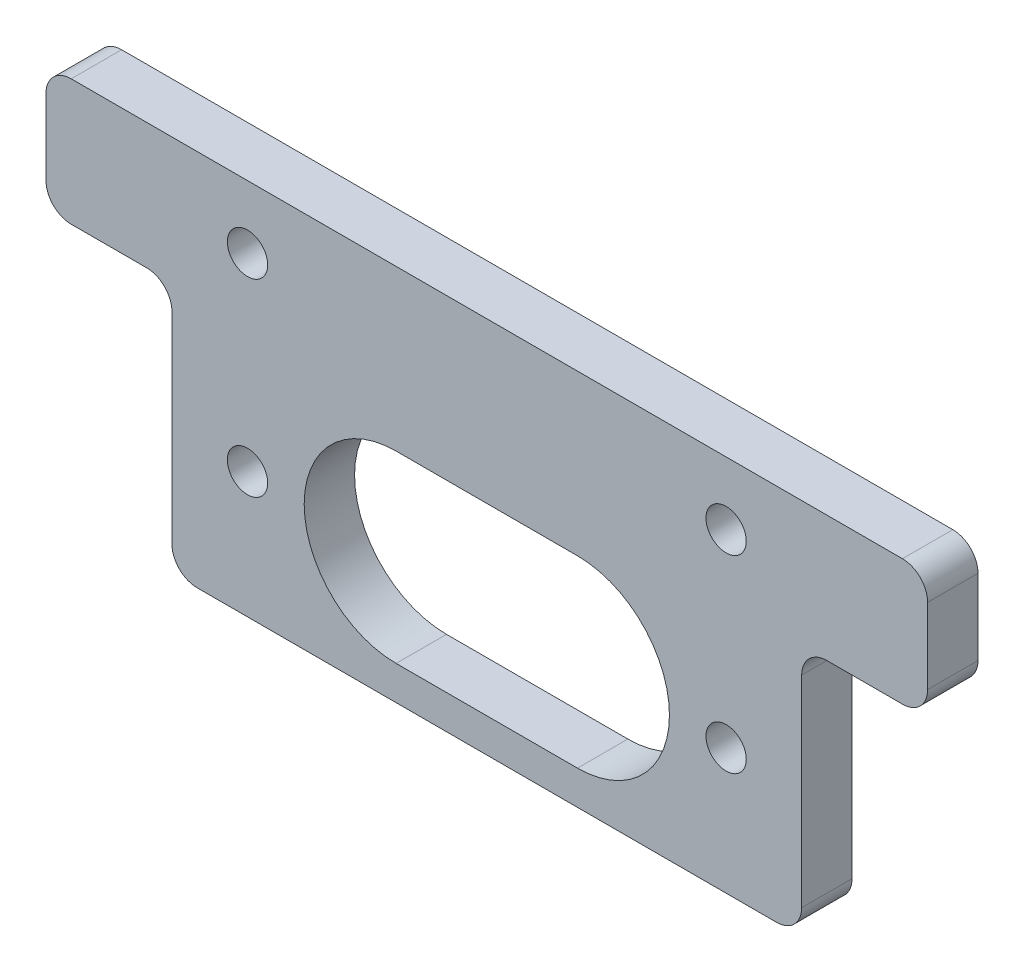
ISO-10303-21;
HEADER;
FILE_DESCRIPTION(('STEP AP214'),'2;1');
FILE_NAME('part.step','',(''),(''),'','','');
FILE_SCHEMA(('AUTOMOTIVE_DESIGN { 1 0 10303 214 1 1 1 1 }'));
ENDSEC;
DATA;
#1=APPLICATION_CONTEXT('core data for automotive mechanical design processes');
#2=APPLICATION_PROTOCOL_DEFINITION('international standard','automotive_design',2000,#1);
#3=PRODUCT_CONTEXT('',#1,'mechanical');
#4=PRODUCT('Part','Part','',(#3));
#5=PRODUCT_RELATED_PRODUCT_CATEGORY('part','',(#4));
#6=PRODUCT_DEFINITION_FORMATION('','',#4);
#7=PRODUCT_DEFINITION_CONTEXT('part definition',#1,'design');
#8=PRODUCT_DEFINITION('design','',#6,#7);
#9=PRODUCT_DEFINITION_SHAPE('','',#8);
#10=(LENGTH_UNIT() NAMED_UNIT(*) SI_UNIT(.MILLI.,.METRE.));
#11=(NAMED_UNIT(*) PLANE_ANGLE_UNIT() SI_UNIT($,.RADIAN.));
#12=(NAMED_UNIT(*) SI_UNIT($,.STERADIAN.) SOLID_ANGLE_UNIT());
#13=UNCERTAINTY_MEASURE_WITH_UNIT(LENGTH_MEASURE(1.E-05),#10,'distance_accuracy_value','');
#14=(GEOMETRIC_REPRESENTATION_CONTEXT(3) GLOBAL_UNCERTAINTY_ASSIGNED_CONTEXT((#13)) GLOBAL_UNIT_ASSIGNED_CONTEXT((#10,
#11,#12)) REPRESENTATION_CONTEXT('',''));
#15=CARTESIAN_POINT('',(0.,0.,0.));
#16=DIRECTION('',(0.,0.,1.));
#17=DIRECTION('',(1.,0.,0.));
#18=AXIS2_PLACEMENT_3D('',#15,#16,#17);
#19=CARTESIAN_POINT('',(-25.,20.,4.));
#20=DIRECTION('',(1.,0.,0.));
#21=DIRECTION('',(0.,0.,-1.));
#22=AXIS2_PLACEMENT_3D('',#19,#20,#21);
#23=PLANE('',#22);
#24=DIRECTION('',(0.,-1.,0.));
#25=VECTOR('',#24,1.);
#26=CARTESIAN_POINT('',(-25.,20.,0.));
#27=LINE('',#26,#25);
#28=CARTESIAN_POINT('',(-25.,18.,0.));
#29=VERTEX_POINT('',#28);
#30=CARTESIAN_POINT('',(-25.,2.,0.));
#31=VERTEX_POINT('',#30);
#32=EDGE_CURVE('E239',#29,#31,#27,.T.);
#33=ORIENTED_EDGE('',*,*,#32,.T.);
#34=DIRECTION('',(0.,0.,-1.));
#35=VECTOR('',#34,1.);
#36=CARTESIAN_POINT('',(-25.,2.,4.));
#37=LINE('',#36,#35);
#38=CARTESIAN_POINT('',(-25.,2.,4.));
#39=VERTEX_POINT('',#38);
#40=EDGE_CURVE('E342',#31,#39,#37,.F.);
#41=ORIENTED_EDGE('',*,*,#40,.T.);
#42=DIRECTION('',(0.,-1.,0.));
#43=VECTOR('',#42,1.);
#44=CARTESIAN_POINT('',(-25.,20.,4.));
#45=LINE('',#44,#43);
#46=CARTESIAN_POINT('',(-25.,18.,4.));
#47=VERTEX_POINT('',#46);
#48=EDGE_CURVE('E242',#47,#39,#45,.T.);
#49=ORIENTED_EDGE('',*,*,#48,.F.);
#50=DIRECTION('',(0.,0.,-1.));
#51=VECTOR('',#50,1.);
#52=CARTESIAN_POINT('',(-25.,18.,0.));
#53=LINE('',#52,#51);
#54=EDGE_CURVE('E339',#47,#29,#53,.T.);
#55=ORIENTED_EDGE('',*,*,#54,.T.);
#56=EDGE_LOOP('',(#33,#41,#49,#55));
#57=FACE_BOUND('',#56,.T.);
#58=ADVANCED_FACE('F36',(#57),#23,.F.);
#59=CARTESIAN_POINT('',(-25.,0.,4.));
#60=DIRECTION('',(0.,1.,0.));
#61=DIRECTION('',(0.,0.,1.));
#62=AXIS2_PLACEMENT_3D('',#59,#60,#61);
#63=PLANE('',#62);
#64=DIRECTION('',(1.,0.,0.));
#65=VECTOR('',#64,1.);
#66=CARTESIAN_POINT('',(-25.,0.,0.));
#67=LINE('',#66,#65);
#68=CARTESIAN_POINT('',(-23.,0.,0.));
#69=VERTEX_POINT('',#68);
#70=CARTESIAN_POINT('',(23.,0.,0.));
#71=VERTEX_POINT('',#70);
#72=EDGE_CURVE('E268',#69,#71,#67,.T.);
#73=ORIENTED_EDGE('',*,*,#72,.T.);
#74=DIRECTION('',(0.,0.,-1.));
#75=VECTOR('',#74,1.);
#76=CARTESIAN_POINT('',(23.,0.,4.));
#77=LINE('',#76,#75);
#78=CARTESIAN_POINT('',(23.,0.,4.));
#79=VERTEX_POINT('',#78);
#80=EDGE_CURVE('E337',#71,#79,#77,.F.);
#81=ORIENTED_EDGE('',*,*,#80,.T.);
#82=DIRECTION('',(1.,0.,0.));
#83=VECTOR('',#82,1.);
#84=CARTESIAN_POINT('',(-25.,0.,4.));
#85=LINE('',#84,#83);
#86=CARTESIAN_POINT('',(-23.,0.,4.));
#87=VERTEX_POINT('',#86);
#88=EDGE_CURVE('E245',#87,#79,#85,.T.);
#89=ORIENTED_EDGE('',*,*,#88,.F.);
#90=DIRECTION('',(0.,0.,-1.));
#91=VECTOR('',#90,1.);
#92=CARTESIAN_POINT('',(-23.,0.,4.));
#93=LINE('',#92,#91);
#94=EDGE_CURVE('E334',#87,#69,#93,.T.);
#95=ORIENTED_EDGE('',*,*,#94,.T.);
#96=EDGE_LOOP('',(#73,#81,#89,#95));
#97=FACE_BOUND('',#96,.T.);
#98=ADVANCED_FACE('F414',(#97),#63,.F.);
#99=CARTESIAN_POINT('',(25.,0.,4.));
#100=DIRECTION('',(-1.,0.,0.));
#101=DIRECTION('',(0.,0.,1.));
#102=AXIS2_PLACEMENT_3D('',#99,#100,#101);
#103=PLANE('',#102);
#104=DIRECTION('',(0.,1.,0.));
#105=VECTOR('',#104,1.);
#106=CARTESIAN_POINT('',(25.,0.,4.));
#107=LINE('',#106,#105);
#108=CARTESIAN_POINT('',(25.,2.,4.));
#109=VERTEX_POINT('',#108);
#110=CARTESIAN_POINT('',(25.,18.,4.));
#111=VERTEX_POINT('',#110);
#112=EDGE_CURVE('E249',#109,#111,#107,.T.);
#113=ORIENTED_EDGE('',*,*,#112,.F.);
#114=DIRECTION('',(0.,0.,-1.));
#115=VECTOR('',#114,1.);
#116=CARTESIAN_POINT('',(25.,2.,4.));
#117=LINE('',#116,#115);
#118=CARTESIAN_POINT('',(25.,2.,0.));
#119=VERTEX_POINT('',#118);
#120=EDGE_CURVE('E331',#109,#119,#117,.T.);
#121=ORIENTED_EDGE('',*,*,#120,.T.);
#122=DIRECTION('',(0.,1.,0.));
#123=VECTOR('',#122,1.);
#124=CARTESIAN_POINT('',(25.,0.,0.));
#125=LINE('',#124,#123);
#126=CARTESIAN_POINT('',(25.,18.,0.));
#127=VERTEX_POINT('',#126);
#128=EDGE_CURVE('E271',#119,#127,#125,.T.);
#129=ORIENTED_EDGE('',*,*,#128,.T.);
#130=DIRECTION('',(0.,0.,-1.));
#131=VECTOR('',#130,1.);
#132=CARTESIAN_POINT('',(25.,18.,4.));
#133=LINE('',#132,#131);
#134=EDGE_CURVE('E329',#127,#111,#133,.F.);
#135=ORIENTED_EDGE('',*,*,#134,.T.);
#136=EDGE_LOOP('',(#113,#121,#129,#135));
#137=FACE_BOUND('',#136,.T.);
#138=ADVANCED_FACE('F360',(#137),#103,.F.);
#139=CARTESIAN_POINT('',(25.,20.,4.));
#140=DIRECTION('',(0.,1.,0.));
#141=DIRECTION('',(-1.,0.,0.));
#142=AXIS2_PLACEMENT_3D('',#139,#140,#141);
#143=PLANE('',#142);
#144=DIRECTION('',(1.,0.,0.));
#145=VECTOR('',#144,1.);
#146=CARTESIAN_POINT('',(25.,20.,0.));
#147=LINE('',#146,#145);
#148=CARTESIAN_POINT('',(27.,20.,0.));
#149=VERTEX_POINT('',#148);
#150=CARTESIAN_POINT('',(33.,20.,0.));
#151=VERTEX_POINT('',#150);
#152=EDGE_CURVE('E274',#149,#151,#147,.T.);
#153=ORIENTED_EDGE('',*,*,#152,.T.);
#154=DIRECTION('',(0.,0.,-1.));
#155=VECTOR('',#154,1.);
#156=CARTESIAN_POINT('',(33.,20.,4.));
#157=LINE('',#156,#155);
#158=CARTESIAN_POINT('',(33.,20.,4.));
#159=VERTEX_POINT('',#158);
#160=EDGE_CURVE('E327',#151,#159,#157,.F.);
#161=ORIENTED_EDGE('',*,*,#160,.T.);
#162=DIRECTION('',(1.,0.,0.));
#163=VECTOR('',#162,1.);
#164=CARTESIAN_POINT('',(25.,20.,4.));
#165=LINE('',#164,#163);
#166=CARTESIAN_POINT('',(27.,20.,4.));
#167=VERTEX_POINT('',#166);
#168=EDGE_CURVE('E252',#167,#159,#165,.T.);
#169=ORIENTED_EDGE('',*,*,#168,.F.);
#170=DIRECTION('',(0.,0.,-1.));
#171=VECTOR('',#170,1.);
#172=CARTESIAN_POINT('',(27.,20.,0.));
#173=LINE('',#172,#171);
#174=EDGE_CURVE('E324',#167,#149,#173,.T.);
#175=ORIENTED_EDGE('',*,*,#174,.T.);
#176=EDGE_LOOP('',(#153,#161,#169,#175));
#177=FACE_BOUND('',#176,.T.);
#178=ADVANCED_FACE('F367',(#177),#143,.F.);
#179=CARTESIAN_POINT('',(35.,20.,4.));
#180=DIRECTION('',(-1.,0.,0.));
#181=DIRECTION('',(0.,0.,1.));
#182=AXIS2_PLACEMENT_3D('',#179,#180,#181);
#183=PLANE('',#182);
#184=DIRECTION('',(0.,1.,0.));
#185=VECTOR('',#184,1.);
#186=CARTESIAN_POINT('',(35.,20.,0.));
#187=LINE('',#186,#185);
#188=CARTESIAN_POINT('',(35.,22.,0.));
#189=VERTEX_POINT('',#188);
#190=CARTESIAN_POINT('',(35.,28.,0.));
#191=VERTEX_POINT('',#190);
#192=EDGE_CURVE('E277',#189,#191,#187,.T.);
#193=ORIENTED_EDGE('',*,*,#192,.T.);
#194=DIRECTION('',(0.,0.,-1.));
#195=VECTOR('',#194,1.);
#196=CARTESIAN_POINT('',(35.,28.,4.));
#197=LINE('',#196,#195);
#198=CARTESIAN_POINT('',(35.,28.,4.));
#199=VERTEX_POINT('',#198);
#200=EDGE_CURVE('E306',#191,#199,#197,.F.);
#201=ORIENTED_EDGE('',*,*,#200,.T.);
#202=DIRECTION('',(0.,1.,0.));
#203=VECTOR('',#202,1.);
#204=CARTESIAN_POINT('',(35.,20.,4.));
#205=LINE('',#204,#203);
#206=CARTESIAN_POINT('',(35.,22.,4.));
#207=VERTEX_POINT('',#206);
#208=EDGE_CURVE('E255',#207,#199,#205,.T.);
#209=ORIENTED_EDGE('',*,*,#208,.F.);
#210=DIRECTION('',(0.,0.,-1.));
#211=VECTOR('',#210,1.);
#212=CARTESIAN_POINT('',(35.,22.,4.));
#213=LINE('',#212,#211);
#214=EDGE_CURVE('E303',#207,#189,#213,.T.);
#215=ORIENTED_EDGE('',*,*,#214,.T.);
#216=EDGE_LOOP('',(#193,#201,#209,#215));
#217=FACE_BOUND('',#216,.T.);
#218=ADVANCED_FACE('F375',(#217),#183,.F.);
#219=CARTESIAN_POINT('',(35.,30.,4.));
#220=DIRECTION('',(0.,-1.,0.));
#221=DIRECTION('',(0.,0.,-1.));
#222=AXIS2_PLACEMENT_3D('',#219,#220,#221);
#223=PLANE('',#222);
#224=DIRECTION('',(-1.,0.,0.));
#225=VECTOR('',#224,1.);
#226=CARTESIAN_POINT('',(35.,30.,4.));
#227=LINE('',#226,#225);
#228=CARTESIAN_POINT('',(33.,30.,4.));
#229=VERTEX_POINT('',#228);
#230=CARTESIAN_POINT('',(-33.,30.,4.));
#231=VERTEX_POINT('',#230);
#232=EDGE_CURVE('E258',#229,#231,#227,.T.);
#233=ORIENTED_EDGE('',*,*,#232,.F.);
#234=DIRECTION('',(0.,0.,-1.));
#235=VECTOR('',#234,1.);
#236=CARTESIAN_POINT('',(33.,30.,4.));
#237=LINE('',#236,#235);
#238=CARTESIAN_POINT('',(33.,30.,0.));
#239=VERTEX_POINT('',#238);
#240=EDGE_CURVE('E288',#229,#239,#237,.T.);
#241=ORIENTED_EDGE('',*,*,#240,.T.);
#242=DIRECTION('',(-1.,0.,0.));
#243=VECTOR('',#242,1.);
#244=CARTESIAN_POINT('',(35.,30.,0.));
#245=LINE('',#244,#243);
#246=CARTESIAN_POINT('',(-33.,30.,0.));
#247=VERTEX_POINT('',#246);
#248=EDGE_CURVE('E280',#239,#247,#245,.T.);
#249=ORIENTED_EDGE('',*,*,#248,.T.);
#250=DIRECTION('',(0.,0.,-1.));
#251=VECTOR('',#250,1.);
#252=CARTESIAN_POINT('',(-33.,30.,4.));
#253=LINE('',#252,#251);
#254=EDGE_CURVE('E265',#247,#231,#253,.F.);
#255=ORIENTED_EDGE('',*,*,#254,.T.);
#256=EDGE_LOOP('',(#233,#241,#249,#255));
#257=FACE_BOUND('',#256,.T.);
#258=ADVANCED_FACE('F384',(#257),#223,.F.);
#259=CARTESIAN_POINT('',(-35.,30.,4.));
#260=DIRECTION('',(1.,0.,0.));
#261=DIRECTION('',(0.,0.,-1.));
#262=AXIS2_PLACEMENT_3D('',#259,#260,#261);
#263=PLANE('',#262);
#264=DIRECTION('',(0.,-1.,0.));
#265=VECTOR('',#264,1.);
#266=CARTESIAN_POINT('',(-35.,30.,4.));
#267=LINE('',#266,#265);
#268=CARTESIAN_POINT('',(-35.,28.,4.));
#269=VERTEX_POINT('',#268);
#270=CARTESIAN_POINT('',(-35.,22.,4.));
#271=VERTEX_POINT('',#270);
#272=EDGE_CURVE('E261',#269,#271,#267,.T.);
#273=ORIENTED_EDGE('',*,*,#272,.F.);
#274=DIRECTION('',(0.,0.,-1.));
#275=VECTOR('',#274,1.);
#276=CARTESIAN_POINT('',(-35.,28.,4.));
#277=LINE('',#276,#275);
#278=CARTESIAN_POINT('',(-35.,28.,0.));
#279=VERTEX_POINT('',#278);
#280=EDGE_CURVE('E321',#269,#279,#277,.T.);
#281=ORIENTED_EDGE('',*,*,#280,.T.);
#282=DIRECTION('',(0.,-1.,0.));
#283=VECTOR('',#282,1.);
#284=CARTESIAN_POINT('',(-35.,30.,0.));
#285=LINE('',#284,#283);
#286=CARTESIAN_POINT('',(-35.,22.,0.));
#287=VERTEX_POINT('',#286);
#288=EDGE_CURVE('E283',#279,#287,#285,.T.);
#289=ORIENTED_EDGE('',*,*,#288,.T.);
#290=DIRECTION('',(0.,0.,-1.));
#291=VECTOR('',#290,1.);
#292=CARTESIAN_POINT('',(-35.,22.,4.));
#293=LINE('',#292,#291);
#294=EDGE_CURVE('E319',#287,#271,#293,.F.);
#295=ORIENTED_EDGE('',*,*,#294,.T.);
#296=EDGE_LOOP('',(#273,#281,#289,#295));
#297=FACE_BOUND('',#296,.T.);
#298=ADVANCED_FACE('F391',(#297),#263,.F.);
#299=CARTESIAN_POINT('',(-35.,20.,4.));
#300=DIRECTION('',(0.,1.,0.));
#301=DIRECTION('',(-1.,0.,0.));
#302=AXIS2_PLACEMENT_3D('',#299,#300,#301);
#303=PLANE('',#302);
#304=DIRECTION('',(1.,0.,0.));
#305=VECTOR('',#304,1.);
#306=CARTESIAN_POINT('',(-35.,20.,4.));
#307=LINE('',#306,#305);
#308=CARTESIAN_POINT('',(-33.,20.,4.));
#309=VERTEX_POINT('',#308);
#310=CARTESIAN_POINT('',(-27.,20.,4.));
#311=VERTEX_POINT('',#310);
#312=EDGE_CURVE('E263',#309,#311,#307,.T.);
#313=ORIENTED_EDGE('',*,*,#312,.F.);
#314=DIRECTION('',(0.,0.,-1.));
#315=VECTOR('',#314,1.);
#316=CARTESIAN_POINT('',(-33.,20.,4.));
#317=LINE('',#316,#315);
#318=CARTESIAN_POINT('',(-33.,20.,0.));
#319=VERTEX_POINT('',#318);
#320=EDGE_CURVE('E345',#309,#319,#317,.T.);
#321=ORIENTED_EDGE('',*,*,#320,.T.);
#322=DIRECTION('',(1.,0.,0.));
#323=VECTOR('',#322,1.);
#324=CARTESIAN_POINT('',(-35.,20.,0.));
#325=LINE('',#324,#323);
#326=CARTESIAN_POINT('',(-27.,20.,0.));
#327=VERTEX_POINT('',#326);
#328=EDGE_CURVE('E246',#319,#327,#325,.T.);
#329=ORIENTED_EDGE('',*,*,#328,.T.);
#330=DIRECTION('',(0.,0.,-1.));
#331=VECTOR('',#330,1.);
#332=CARTESIAN_POINT('',(-27.,20.,4.));
#333=LINE('',#332,#331);
#334=EDGE_CURVE('E51',#327,#311,#333,.F.);
#335=ORIENTED_EDGE('',*,*,#334,.T.);
#336=EDGE_LOOP('',(#313,#321,#329,#335));
#337=FACE_BOUND('',#336,.T.);
#338=ADVANCED_FACE('F398',(#337),#303,.F.);
#339=CARTESIAN_POINT('',(0.,0.,4.));
#340=DIRECTION('',(0.,0.,1.));
#341=DIRECTION('',(1.,0.,0.));
#342=AXIS2_PLACEMENT_3D('',#339,#340,#341);
#343=PLANE('',#342);
#344=CARTESIAN_POINT('',(-7.2,10.,4.));
#345=DIRECTION('',(0.,0.,1.));
#346=DIRECTION('',(1.,0.,0.));
#347=AXIS2_PLACEMENT_3D('',#344,#345,#346);
#348=CIRCLE('',#347,7.3);
#349=CARTESIAN_POINT('',(-7.2,17.3,4.));
#350=VERTEX_POINT('',#349);
#351=CARTESIAN_POINT('',(-7.2,2.7,4.));
#352=VERTEX_POINT('',#351);
#353=EDGE_CURVE('E181',#350,#352,#348,.T.);
#354=ORIENTED_EDGE('',*,*,#353,.F.);
#355=DIRECTION('',(-1.,0.,0.));
#356=VECTOR('',#355,1.);
#357=CARTESIAN_POINT('',(-7.2,17.3,4.));
#358=LINE('',#357,#356);
#359=CARTESIAN_POINT('',(7.2,17.3,4.));
#360=VERTEX_POINT('',#359);
#361=EDGE_CURVE('E199',#360,#350,#358,.T.);
#362=ORIENTED_EDGE('',*,*,#361,.F.);
#363=CARTESIAN_POINT('',(7.2,10.,4.));
#364=DIRECTION('',(0.,0.,1.));
#365=DIRECTION('',(1.,0.,0.));
#366=AXIS2_PLACEMENT_3D('',#363,#364,#365);
#367=CIRCLE('',#366,7.3);
#368=CARTESIAN_POINT('',(7.2,2.7,4.));
#369=VERTEX_POINT('',#368);
#370=EDGE_CURVE('E202',#369,#360,#367,.T.);
#371=ORIENTED_EDGE('',*,*,#370,.F.);
#372=DIRECTION('',(1.,0.,0.));
#373=VECTOR('',#372,1.);
#374=CARTESIAN_POINT('',(-7.2,2.7,4.));
#375=LINE('',#374,#373);
#376=EDGE_CURVE('E208',#352,#369,#375,.T.);
#377=ORIENTED_EDGE('',*,*,#376,.F.);
#378=EDGE_LOOP('',(#354,#362,#371,#377));
#379=FACE_BOUND('',#378,.T.);
#380=CARTESIAN_POINT('',(19.,25.,4.));
#381=DIRECTION('',(0.,0.,1.));
#382=DIRECTION('',(1.,0.,0.));
#383=AXIS2_PLACEMENT_3D('',#380,#381,#382);
#384=CIRCLE('',#383,1.6);
#385=CARTESIAN_POINT('',(20.6,25.,4.));
#386=VERTEX_POINT('',#385);
#387=EDGE_CURVE('E228',#386,#386,#384,.T.);
#388=ORIENTED_EDGE('',*,*,#387,.F.);
#389=EDGE_LOOP('',(#388));
#390=FACE_BOUND('',#389,.T.);
#391=CARTESIAN_POINT('',(-19.,10.,4.));
#392=DIRECTION('',(0.,0.,1.));
#393=DIRECTION('',(-1.,0.,0.));
#394=AXIS2_PLACEMENT_3D('',#391,#392,#393);
#395=CIRCLE('',#394,1.6);
#396=CARTESIAN_POINT('',(-20.6,10.,4.));
#397=VERTEX_POINT('',#396);
#398=EDGE_CURVE('E221',#397,#397,#395,.T.);
#399=ORIENTED_EDGE('',*,*,#398,.F.);
#400=EDGE_LOOP('',(#399));
#401=FACE_BOUND('',#400,.T.);
#402=CARTESIAN_POINT('',(-19.,25.,4.));
#403=DIRECTION('',(0.,0.,1.));
#404=DIRECTION('',(-1.,0.,0.));
#405=AXIS2_PLACEMENT_3D('',#402,#403,#404);
#406=CIRCLE('',#405,1.6);
#407=CARTESIAN_POINT('',(-20.6,25.,4.));
#408=VERTEX_POINT('',#407);
#409=EDGE_CURVE('E214',#408,#408,#406,.T.);
#410=ORIENTED_EDGE('',*,*,#409,.F.);
#411=EDGE_LOOP('',(#410));
#412=FACE_BOUND('',#411,.T.);
#413=CARTESIAN_POINT('',(19.,10.,4.));
#414=DIRECTION('',(0.,0.,1.));
#415=DIRECTION('',(1.,0.,0.));
#416=AXIS2_PLACEMENT_3D('',#413,#414,#415);
#417=CIRCLE('',#416,1.6);
#418=CARTESIAN_POINT('',(20.6,10.,4.));
#419=VERTEX_POINT('',#418);
#420=EDGE_CURVE('E227',#419,#419,#417,.T.);
#421=ORIENTED_EDGE('',*,*,#420,.F.);
#422=EDGE_LOOP('',(#421));
#423=FACE_BOUND('',#422,.T.);
#424=ORIENTED_EDGE('',*,*,#208,.T.);
#425=CARTESIAN_POINT('',(33.,28.,4.));
#426=DIRECTION('',(0.,0.,1.));
#427=DIRECTION('',(1.,0.,0.));
#428=AXIS2_PLACEMENT_3D('',#425,#426,#427);
#429=CIRCLE('',#428,2.);
#430=EDGE_CURVE('E317',#199,#229,#429,.T.);
#431=ORIENTED_EDGE('',*,*,#430,.T.);
#432=ORIENTED_EDGE('',*,*,#232,.T.);
#433=CARTESIAN_POINT('',(-33.,28.,4.));
#434=DIRECTION('',(0.,0.,1.));
#435=DIRECTION('',(1.,0.,0.));
#436=AXIS2_PLACEMENT_3D('',#433,#434,#435);
#437=CIRCLE('',#436,2.);
#438=EDGE_CURVE('E315',#231,#269,#437,.T.);
#439=ORIENTED_EDGE('',*,*,#438,.T.);
#440=ORIENTED_EDGE('',*,*,#272,.T.);
#441=CARTESIAN_POINT('',(-33.,22.,4.));
#442=DIRECTION('',(0.,0.,1.));
#443=DIRECTION('',(1.,0.,0.));
#444=AXIS2_PLACEMENT_3D('',#441,#442,#443);
#445=CIRCLE('',#444,2.);
#446=EDGE_CURVE('E58',#271,#309,#445,.T.);
#447=ORIENTED_EDGE('',*,*,#446,.T.);
#448=ORIENTED_EDGE('',*,*,#312,.T.);
#449=CARTESIAN_POINT('',(-27.,18.,4.));
#450=DIRECTION('',(0.,0.,1.));
#451=DIRECTION('',(1.,0.,0.));
#452=AXIS2_PLACEMENT_3D('',#449,#450,#451);
#453=CIRCLE('',#452,2.);
#454=EDGE_CURVE('E350',#311,#47,#453,.F.);
#455=ORIENTED_EDGE('',*,*,#454,.T.);
#456=ORIENTED_EDGE('',*,*,#48,.T.);
#457=CARTESIAN_POINT('',(-23.,2.,4.));
#458=DIRECTION('',(0.,0.,1.));
#459=DIRECTION('',(1.,0.,0.));
#460=AXIS2_PLACEMENT_3D('',#457,#458,#459);
#461=CIRCLE('',#460,2.);
#462=EDGE_CURVE('E309',#39,#87,#461,.T.);
#463=ORIENTED_EDGE('',*,*,#462,.T.);
#464=ORIENTED_EDGE('',*,*,#88,.T.);
#465=CARTESIAN_POINT('',(23.,2.,4.));
#466=DIRECTION('',(0.,0.,1.));
#467=DIRECTION('',(1.,0.,0.));
#468=AXIS2_PLACEMENT_3D('',#465,#466,#467);
#469=CIRCLE('',#468,2.);
#470=EDGE_CURVE('E311',#79,#109,#469,.T.);
#471=ORIENTED_EDGE('',*,*,#470,.T.);
#472=ORIENTED_EDGE('',*,*,#112,.T.);
#473=CARTESIAN_POINT('',(27.,18.,4.));
#474=DIRECTION('',(0.,0.,1.));
#475=DIRECTION('',(1.,0.,0.));
#476=AXIS2_PLACEMENT_3D('',#473,#474,#475);
#477=CIRCLE('',#476,2.);
#478=EDGE_CURVE('E11',#111,#167,#477,.F.);
#479=ORIENTED_EDGE('',*,*,#478,.T.);
#480=ORIENTED_EDGE('',*,*,#168,.T.);
#481=CARTESIAN_POINT('',(33.,22.,4.));
#482=DIRECTION('',(0.,0.,1.));
#483=DIRECTION('',(1.,0.,0.));
#484=AXIS2_PLACEMENT_3D('',#481,#482,#483);
#485=CIRCLE('',#484,2.);
#486=EDGE_CURVE('E313',#159,#207,#485,.T.);
#487=ORIENTED_EDGE('',*,*,#486,.T.);
#488=EDGE_LOOP('',(#424,#431,#432,#439,#440,#447,#448,#455,#456,#463,#464,#471,#472,#479,#480,#487));
#489=FACE_BOUND('',#488,.T.);
#490=ADVANCED_FACE('F364',(#379,#390,#401,#412,#423,#489),#343,.T.);
#491=CARTESIAN_POINT('',(0.,0.,0.));
#492=DIRECTION('',(0.,0.,1.));
#493=DIRECTION('',(1.,0.,0.));
#494=AXIS2_PLACEMENT_3D('',#491,#492,#493);
#495=PLANE('',#494);
#496=DIRECTION('',(-1.,0.,0.));
#497=VECTOR('',#496,1.);
#498=CARTESIAN_POINT('',(-7.2,17.3,0.));
#499=LINE('',#498,#497);
#500=CARTESIAN_POINT('',(7.2,17.3,0.));
#501=VERTEX_POINT('',#500);
#502=CARTESIAN_POINT('',(-7.2,17.3,0.));
#503=VERTEX_POINT('',#502);
#504=EDGE_CURVE('E186',#501,#503,#499,.T.);
#505=ORIENTED_EDGE('',*,*,#504,.T.);
#506=CARTESIAN_POINT('',(-7.2,10.,0.));
#507=DIRECTION('',(0.,0.,1.));
#508=DIRECTION('',(1.,0.,0.));
#509=AXIS2_PLACEMENT_3D('',#506,#507,#508);
#510=CIRCLE('',#509,7.3);
#511=CARTESIAN_POINT('',(-7.2,2.7,0.));
#512=VERTEX_POINT('',#511);
#513=EDGE_CURVE('E178',#503,#512,#510,.T.);
#514=ORIENTED_EDGE('',*,*,#513,.T.);
#515=DIRECTION('',(1.,0.,0.));
#516=VECTOR('',#515,1.);
#517=CARTESIAN_POINT('',(-7.2,2.7,0.));
#518=LINE('',#517,#516);
#519=CARTESIAN_POINT('',(7.2,2.7,0.));
#520=VERTEX_POINT('',#519);
#521=EDGE_CURVE('E190',#512,#520,#518,.T.);
#522=ORIENTED_EDGE('',*,*,#521,.T.);
#523=CARTESIAN_POINT('',(7.2,10.,0.));
#524=DIRECTION('',(0.,0.,1.));
#525=DIRECTION('',(1.,0.,0.));
#526=AXIS2_PLACEMENT_3D('',#523,#524,#525);
#527=CIRCLE('',#526,7.3);
#528=EDGE_CURVE('E194',#520,#501,#527,.T.);
#529=ORIENTED_EDGE('',*,*,#528,.T.);
#530=EDGE_LOOP('',(#505,#514,#522,#529));
#531=FACE_BOUND('',#530,.T.);
#532=CARTESIAN_POINT('',(19.,25.,0.));
#533=DIRECTION('',(0.,0.,1.));
#534=DIRECTION('',(1.,0.,0.));
#535=AXIS2_PLACEMENT_3D('',#532,#533,#534);
#536=CIRCLE('',#535,1.6);
#537=CARTESIAN_POINT('',(20.6,25.,0.));
#538=VERTEX_POINT('',#537);
#539=EDGE_CURVE('E224',#538,#538,#536,.T.);
#540=ORIENTED_EDGE('',*,*,#539,.T.);
#541=EDGE_LOOP('',(#540));
#542=FACE_BOUND('',#541,.T.);
#543=CARTESIAN_POINT('',(-19.,10.,0.));
#544=DIRECTION('',(0.,0.,1.));
#545=DIRECTION('',(-1.,0.,0.));
#546=AXIS2_PLACEMENT_3D('',#543,#544,#545);
#547=CIRCLE('',#546,1.6);
#548=CARTESIAN_POINT('',(-20.6,10.,0.));
#549=VERTEX_POINT('',#548);
#550=EDGE_CURVE('E231',#549,#549,#547,.T.);
#551=ORIENTED_EDGE('',*,*,#550,.T.);
#552=EDGE_LOOP('',(#551));
#553=FACE_BOUND('',#552,.T.);
#554=CARTESIAN_POINT('',(-19.,25.,0.));
#555=DIRECTION('',(0.,0.,1.));
#556=DIRECTION('',(-1.,0.,0.));
#557=AXIS2_PLACEMENT_3D('',#554,#555,#556);
#558=CIRCLE('',#557,1.6);
#559=CARTESIAN_POINT('',(-20.6,25.,0.));
#560=VERTEX_POINT('',#559);
#561=EDGE_CURVE('E218',#560,#560,#558,.T.);
#562=ORIENTED_EDGE('',*,*,#561,.T.);
#563=EDGE_LOOP('',(#562));
#564=FACE_BOUND('',#563,.T.);
#565=CARTESIAN_POINT('',(19.,10.,0.));
#566=DIRECTION('',(0.,0.,1.));
#567=DIRECTION('',(1.,0.,0.));
#568=AXIS2_PLACEMENT_3D('',#565,#566,#567);
#569=CIRCLE('',#568,1.6);
#570=CARTESIAN_POINT('',(20.6,10.,0.));
#571=VERTEX_POINT('',#570);
#572=EDGE_CURVE('E236',#571,#571,#569,.T.);
#573=ORIENTED_EDGE('',*,*,#572,.T.);
#574=EDGE_LOOP('',(#573));
#575=FACE_BOUND('',#574,.T.);
#576=ORIENTED_EDGE('',*,*,#248,.F.);
#577=CARTESIAN_POINT('',(33.,28.,0.));
#578=DIRECTION('',(0.,0.,1.));
#579=DIRECTION('',(1.,0.,0.));
#580=AXIS2_PLACEMENT_3D('',#577,#578,#579);
#581=CIRCLE('',#580,2.);
#582=EDGE_CURVE('E301',#239,#191,#581,.F.);
#583=ORIENTED_EDGE('',*,*,#582,.T.);
#584=ORIENTED_EDGE('',*,*,#192,.F.);
#585=CARTESIAN_POINT('',(33.,22.,0.));
#586=DIRECTION('',(0.,0.,1.));
#587=DIRECTION('',(1.,0.,0.));
#588=AXIS2_PLACEMENT_3D('',#585,#586,#587);
#589=CIRCLE('',#588,2.);
#590=EDGE_CURVE('E297',#189,#151,#589,.F.);
#591=ORIENTED_EDGE('',*,*,#590,.T.);
#592=ORIENTED_EDGE('',*,*,#152,.F.);
#593=CARTESIAN_POINT('',(27.,18.,0.));
#594=DIRECTION('',(0.,0.,1.));
#595=DIRECTION('',(1.,0.,0.));
#596=AXIS2_PLACEMENT_3D('',#593,#594,#595);
#597=CIRCLE('',#596,2.);
#598=EDGE_CURVE('E44',#149,#127,#597,.T.);
#599=ORIENTED_EDGE('',*,*,#598,.T.);
#600=ORIENTED_EDGE('',*,*,#128,.F.);
#601=CARTESIAN_POINT('',(23.,2.,0.));
#602=DIRECTION('',(0.,0.,1.));
#603=DIRECTION('',(1.,0.,0.));
#604=AXIS2_PLACEMENT_3D('',#601,#602,#603);
#605=CIRCLE('',#604,2.);
#606=EDGE_CURVE('E295',#119,#71,#605,.F.);
#607=ORIENTED_EDGE('',*,*,#606,.T.);
#608=ORIENTED_EDGE('',*,*,#72,.F.);
#609=CARTESIAN_POINT('',(-23.,2.,0.));
#610=DIRECTION('',(0.,0.,1.));
#611=DIRECTION('',(1.,0.,0.));
#612=AXIS2_PLACEMENT_3D('',#609,#610,#611);
#613=CIRCLE('',#612,2.);
#614=EDGE_CURVE('E293',#69,#31,#613,.F.);
#615=ORIENTED_EDGE('',*,*,#614,.T.);
#616=ORIENTED_EDGE('',*,*,#32,.F.);
#617=CARTESIAN_POINT('',(-27.,18.,0.));
#618=DIRECTION('',(0.,0.,1.));
#619=DIRECTION('',(1.,0.,0.));
#620=AXIS2_PLACEMENT_3D('',#617,#618,#619);
#621=CIRCLE('',#620,2.);
#622=EDGE_CURVE('E348',#29,#327,#621,.T.);
#623=ORIENTED_EDGE('',*,*,#622,.T.);
#624=ORIENTED_EDGE('',*,*,#328,.F.);
#625=CARTESIAN_POINT('',(-33.,22.,0.));
#626=DIRECTION('',(0.,0.,1.));
#627=DIRECTION('',(1.,0.,0.));
#628=AXIS2_PLACEMENT_3D('',#625,#626,#627);
#629=CIRCLE('',#628,2.);
#630=EDGE_CURVE('E291',#319,#287,#629,.F.);
#631=ORIENTED_EDGE('',*,*,#630,.T.);
#632=ORIENTED_EDGE('',*,*,#288,.F.);
#633=CARTESIAN_POINT('',(-33.,28.,0.));
#634=DIRECTION('',(0.,0.,1.));
#635=DIRECTION('',(1.,0.,0.));
#636=AXIS2_PLACEMENT_3D('',#633,#634,#635);
#637=CIRCLE('',#636,2.);
#638=EDGE_CURVE('E299',#279,#247,#637,.F.);
#639=ORIENTED_EDGE('',*,*,#638,.T.);
#640=EDGE_LOOP('',(#576,#583,#584,#591,#592,#599,#600,#607,#608,#615,#616,#623,#624,#631,#632,#639));
#641=FACE_BOUND('',#640,.T.);
#642=ADVANCED_FACE('F196',(#531,#542,#553,#564,#575,#641),#495,.F.);
#643=CARTESIAN_POINT('',(19.,10.,0.));
#644=DIRECTION('',(0.,0.,1.));
#645=DIRECTION('',(1.,0.,0.));
#646=AXIS2_PLACEMENT_3D('',#643,#644,#645);
#647=CYLINDRICAL_SURFACE('',#646,1.6);
#648=ORIENTED_EDGE('',*,*,#572,.F.);
#649=EDGE_LOOP('',(#648));
#650=FACE_BOUND('',#649,.T.);
#651=ORIENTED_EDGE('',*,*,#420,.T.);
#652=EDGE_LOOP('',(#651));
#653=FACE_BOUND('',#652,.T.);
#654=ADVANCED_FACE('F546',(#650,#653),#647,.F.);
#655=CARTESIAN_POINT('',(-19.,25.,0.));
#656=DIRECTION('',(0.,0.,1.));
#657=DIRECTION('',(1.,0.,0.));
#658=AXIS2_PLACEMENT_3D('',#655,#656,#657);
#659=CYLINDRICAL_SURFACE('',#658,1.6);
#660=ORIENTED_EDGE('',*,*,#561,.F.);
#661=EDGE_LOOP('',(#660));
#662=FACE_BOUND('',#661,.T.);
#663=ORIENTED_EDGE('',*,*,#409,.T.);
#664=EDGE_LOOP('',(#663));
#665=FACE_BOUND('',#664,.T.);
#666=ADVANCED_FACE('F537',(#662,#665),#659,.F.);
#667=CARTESIAN_POINT('',(-19.,10.,0.));
#668=DIRECTION('',(0.,0.,1.));
#669=DIRECTION('',(1.,0.,0.));
#670=AXIS2_PLACEMENT_3D('',#667,#668,#669);
#671=CYLINDRICAL_SURFACE('',#670,1.6);
#672=ORIENTED_EDGE('',*,*,#550,.F.);
#673=EDGE_LOOP('',(#672));
#674=FACE_BOUND('',#673,.T.);
#675=ORIENTED_EDGE('',*,*,#398,.T.);
#676=EDGE_LOOP('',(#675));
#677=FACE_BOUND('',#676,.T.);
#678=ADVANCED_FACE('F528',(#674,#677),#671,.F.);
#679=CARTESIAN_POINT('',(19.,25.,0.));
#680=DIRECTION('',(0.,0.,1.));
#681=DIRECTION('',(1.,0.,0.));
#682=AXIS2_PLACEMENT_3D('',#679,#680,#681);
#683=CYLINDRICAL_SURFACE('',#682,1.6);
#684=ORIENTED_EDGE('',*,*,#539,.F.);
#685=EDGE_LOOP('',(#684));
#686=FACE_BOUND('',#685,.T.);
#687=ORIENTED_EDGE('',*,*,#387,.T.);
#688=EDGE_LOOP('',(#687));
#689=FACE_BOUND('',#688,.T.);
#690=ADVANCED_FACE('F520',(#686,#689),#683,.F.);
#691=CARTESIAN_POINT('',(-7.2,10.,0.));
#692=DIRECTION('',(0.,0.,1.));
#693=DIRECTION('',(1.,0.,0.));
#694=AXIS2_PLACEMENT_3D('',#691,#692,#693);
#695=CYLINDRICAL_SURFACE('',#694,7.3);
#696=ORIENTED_EDGE('',*,*,#353,.T.);
#697=DIRECTION('',(0.,0.,1.));
#698=VECTOR('',#697,1.);
#699=CARTESIAN_POINT('',(-7.2,2.7,0.));
#700=LINE('',#699,#698);
#701=EDGE_CURVE('E174',#512,#352,#700,.T.);
#702=ORIENTED_EDGE('',*,*,#701,.F.);
#703=ORIENTED_EDGE('',*,*,#513,.F.);
#704=DIRECTION('',(0.,0.,1.));
#705=VECTOR('',#704,1.);
#706=CARTESIAN_POINT('',(-7.2,17.3,0.));
#707=LINE('',#706,#705);
#708=EDGE_CURVE('E212',#503,#350,#707,.T.);
#709=ORIENTED_EDGE('',*,*,#708,.T.);
#710=EDGE_LOOP('',(#696,#702,#703,#709));
#711=FACE_BOUND('',#710,.T.);
#712=ADVANCED_FACE('F176',(#711),#695,.F.);
#713=CARTESIAN_POINT('',(-7.2,17.3,0.));
#714=DIRECTION('',(0.,1.,0.));
#715=DIRECTION('',(0.,0.,1.));
#716=AXIS2_PLACEMENT_3D('',#713,#714,#715);
#717=PLANE('',#716);
#718=ORIENTED_EDGE('',*,*,#361,.T.);
#719=ORIENTED_EDGE('',*,*,#708,.F.);
#720=ORIENTED_EDGE('',*,*,#504,.F.);
#721=DIRECTION('',(0.,0.,1.));
#722=VECTOR('',#721,1.);
#723=CARTESIAN_POINT('',(7.2,17.3,0.));
#724=LINE('',#723,#722);
#725=EDGE_CURVE('E215',#501,#360,#724,.T.);
#726=ORIENTED_EDGE('',*,*,#725,.T.);
#727=EDGE_LOOP('',(#718,#719,#720,#726));
#728=FACE_BOUND('',#727,.T.);
#729=ADVANCED_FACE('F503',(#728),#717,.F.);
#730=CARTESIAN_POINT('',(7.2,10.,0.));
#731=DIRECTION('',(0.,0.,1.));
#732=DIRECTION('',(1.,0.,0.));
#733=AXIS2_PLACEMENT_3D('',#730,#731,#732);
#734=CYLINDRICAL_SURFACE('',#733,7.3);
#735=ORIENTED_EDGE('',*,*,#370,.T.);
#736=ORIENTED_EDGE('',*,*,#725,.F.);
#737=ORIENTED_EDGE('',*,*,#528,.F.);
#738=DIRECTION('',(0.,0.,1.));
#739=VECTOR('',#738,1.);
#740=CARTESIAN_POINT('',(7.2,2.7,0.));
#741=LINE('',#740,#739);
#742=EDGE_CURVE('E185',#520,#369,#741,.T.);
#743=ORIENTED_EDGE('',*,*,#742,.T.);
#744=EDGE_LOOP('',(#735,#736,#737,#743));
#745=FACE_BOUND('',#744,.T.);
#746=ADVANCED_FACE('F495',(#745),#734,.F.);
#747=CARTESIAN_POINT('',(-7.2,2.7,0.));
#748=DIRECTION('',(0.,-1.,0.));
#749=DIRECTION('',(1.,0.,0.));
#750=AXIS2_PLACEMENT_3D('',#747,#748,#749);
#751=PLANE('',#750);
#752=ORIENTED_EDGE('',*,*,#376,.T.);
#753=ORIENTED_EDGE('',*,*,#742,.F.);
#754=ORIENTED_EDGE('',*,*,#521,.F.);
#755=ORIENTED_EDGE('',*,*,#701,.T.);
#756=EDGE_LOOP('',(#752,#753,#754,#755));
#757=FACE_BOUND('',#756,.T.);
#758=ADVANCED_FACE('F191',(#757),#751,.F.);
#759=CARTESIAN_POINT('',(33.,28.,4.));
#760=DIRECTION('',(0.,0.,-1.));
#761=DIRECTION('',(-1.,0.,0.));
#762=AXIS2_PLACEMENT_3D('',#759,#760,#761);
#763=CYLINDRICAL_SURFACE('',#762,2.);
#764=ORIENTED_EDGE('',*,*,#430,.F.);
#765=ORIENTED_EDGE('',*,*,#200,.F.);
#766=ORIENTED_EDGE('',*,*,#582,.F.);
#767=ORIENTED_EDGE('',*,*,#240,.F.);
#768=EDGE_LOOP('',(#764,#765,#766,#767));
#769=FACE_BOUND('',#768,.T.);
#770=ADVANCED_FACE('F379',(#769),#763,.T.);
#771=CARTESIAN_POINT('',(-33.,28.,4.));
#772=DIRECTION('',(0.,0.,-1.));
#773=DIRECTION('',(-1.,0.,0.));
#774=AXIS2_PLACEMENT_3D('',#771,#772,#773);
#775=CYLINDRICAL_SURFACE('',#774,2.);
#776=ORIENTED_EDGE('',*,*,#438,.F.);
#777=ORIENTED_EDGE('',*,*,#254,.F.);
#778=ORIENTED_EDGE('',*,*,#638,.F.);
#779=ORIENTED_EDGE('',*,*,#280,.F.);
#780=EDGE_LOOP('',(#776,#777,#778,#779));
#781=FACE_BOUND('',#780,.T.);
#782=ADVANCED_FACE('F387',(#781),#775,.T.);
#783=CARTESIAN_POINT('',(33.,22.,4.));
#784=DIRECTION('',(0.,0.,-1.));
#785=DIRECTION('',(-1.,0.,0.));
#786=AXIS2_PLACEMENT_3D('',#783,#784,#785);
#787=CYLINDRICAL_SURFACE('',#786,2.);
#788=ORIENTED_EDGE('',*,*,#486,.F.);
#789=ORIENTED_EDGE('',*,*,#160,.F.);
#790=ORIENTED_EDGE('',*,*,#590,.F.);
#791=ORIENTED_EDGE('',*,*,#214,.F.);
#792=EDGE_LOOP('',(#788,#789,#790,#791));
#793=FACE_BOUND('',#792,.T.);
#794=ADVANCED_FACE('F370',(#793),#787,.T.);
#795=CARTESIAN_POINT('',(23.,2.,4.));
#796=DIRECTION('',(0.,0.,-1.));
#797=DIRECTION('',(-1.,0.,0.));
#798=AXIS2_PLACEMENT_3D('',#795,#796,#797);
#799=CYLINDRICAL_SURFACE('',#798,2.);
#800=ORIENTED_EDGE('',*,*,#470,.F.);
#801=ORIENTED_EDGE('',*,*,#80,.F.);
#802=ORIENTED_EDGE('',*,*,#606,.F.);
#803=ORIENTED_EDGE('',*,*,#120,.F.);
#804=EDGE_LOOP('',(#800,#801,#802,#803));
#805=FACE_BOUND('',#804,.T.);
#806=ADVANCED_FACE('F418',(#805),#799,.T.);
#807=CARTESIAN_POINT('',(-23.,2.,4.));
#808=DIRECTION('',(0.,0.,-1.));
#809=DIRECTION('',(-1.,0.,0.));
#810=AXIS2_PLACEMENT_3D('',#807,#808,#809);
#811=CYLINDRICAL_SURFACE('',#810,2.);
#812=ORIENTED_EDGE('',*,*,#462,.F.);
#813=ORIENTED_EDGE('',*,*,#40,.F.);
#814=ORIENTED_EDGE('',*,*,#614,.F.);
#815=ORIENTED_EDGE('',*,*,#94,.F.);
#816=EDGE_LOOP('',(#812,#813,#814,#815));
#817=FACE_BOUND('',#816,.T.);
#818=ADVANCED_FACE('F411',(#817),#811,.T.);
#819=CARTESIAN_POINT('',(-33.,22.,4.));
#820=DIRECTION('',(0.,0.,-1.));
#821=DIRECTION('',(-1.,0.,0.));
#822=AXIS2_PLACEMENT_3D('',#819,#820,#821);
#823=CYLINDRICAL_SURFACE('',#822,2.);
#824=ORIENTED_EDGE('',*,*,#446,.F.);
#825=ORIENTED_EDGE('',*,*,#294,.F.);
#826=ORIENTED_EDGE('',*,*,#630,.F.);
#827=ORIENTED_EDGE('',*,*,#320,.F.);
#828=EDGE_LOOP('',(#824,#825,#826,#827));
#829=FACE_BOUND('',#828,.T.);
#830=ADVANCED_FACE('F395',(#829),#823,.T.);
#831=CARTESIAN_POINT('',(-27.,18.,4.));
#832=DIRECTION('',(0.,0.,1.));
#833=DIRECTION('',(1.,0.,0.));
#834=AXIS2_PLACEMENT_3D('',#831,#832,#833);
#835=CYLINDRICAL_SURFACE('',#834,2.);
#836=ORIENTED_EDGE('',*,*,#454,.F.);
#837=ORIENTED_EDGE('',*,*,#334,.F.);
#838=ORIENTED_EDGE('',*,*,#622,.F.);
#839=ORIENTED_EDGE('',*,*,#54,.F.);
#840=EDGE_LOOP('',(#836,#837,#838,#839));
#841=FACE_BOUND('',#840,.T.);
#842=ADVANCED_FACE('F403',(#841),#835,.F.);
#843=CARTESIAN_POINT('',(27.,18.,4.));
#844=DIRECTION('',(0.,0.,1.));
#845=DIRECTION('',(1.,0.,0.));
#846=AXIS2_PLACEMENT_3D('',#843,#844,#845);
#847=CYLINDRICAL_SURFACE('',#846,2.);
#848=ORIENTED_EDGE('',*,*,#478,.F.);
#849=ORIENTED_EDGE('',*,*,#134,.F.);
#850=ORIENTED_EDGE('',*,*,#598,.F.);
#851=ORIENTED_EDGE('',*,*,#174,.F.);
#852=EDGE_LOOP('',(#848,#849,#850,#851));
#853=FACE_BOUND('',#852,.T.);
#854=ADVANCED_FACE('F38',(#853),#847,.F.);
#855=CLOSED_SHELL('',(#58,#98,#138,#178,#218,#258,#298,#338,#490,#642,#654,#666,#678,#690,#712,
#729,#746,#758,#770,#782,#794,#806,#818,#830,#842,#854));
#856=MANIFOLD_SOLID_BREP('B2',#855);
#857=ADVANCED_BREP_SHAPE_REPRESENTATION('',(#18,#856),#14);
#858=SHAPE_DEFINITION_REPRESENTATION(#9,#857);
ENDSEC;
END-ISO-10303-21;
